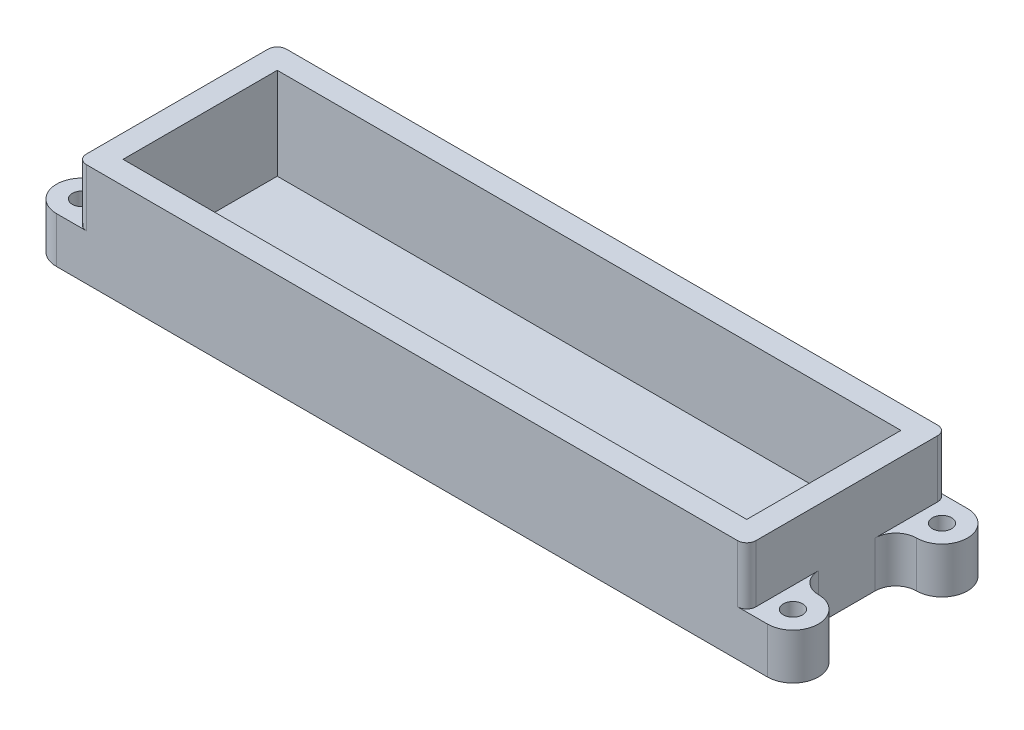
ISO-10303-21;
HEADER;
FILE_DESCRIPTION(('STEP AP214'),'2;1');
FILE_NAME('part.step','',(''),(''),'','','');
FILE_SCHEMA(('AUTOMOTIVE_DESIGN { 1 0 10303 214 1 1 1 1 }'));
ENDSEC;
DATA;
#1=APPLICATION_CONTEXT('core data for automotive mechanical design processes');
#2=APPLICATION_PROTOCOL_DEFINITION('international standard','automotive_design',2000,#1);
#3=PRODUCT_CONTEXT('',#1,'mechanical');
#4=PRODUCT('Part','Part','',(#3));
#5=PRODUCT_RELATED_PRODUCT_CATEGORY('part','',(#4));
#6=PRODUCT_DEFINITION_FORMATION('','',#4);
#7=PRODUCT_DEFINITION_CONTEXT('part definition',#1,'design');
#8=PRODUCT_DEFINITION('design','',#6,#7);
#9=PRODUCT_DEFINITION_SHAPE('','',#8);
#10=(LENGTH_UNIT() NAMED_UNIT(*) SI_UNIT(.MILLI.,.METRE.));
#11=(NAMED_UNIT(*) PLANE_ANGLE_UNIT() SI_UNIT($,.RADIAN.));
#12=(NAMED_UNIT(*) SI_UNIT($,.STERADIAN.) SOLID_ANGLE_UNIT());
#13=UNCERTAINTY_MEASURE_WITH_UNIT(LENGTH_MEASURE(1.E-05),#10,'distance_accuracy_value','');
#14=(GEOMETRIC_REPRESENTATION_CONTEXT(3) GLOBAL_UNCERTAINTY_ASSIGNED_CONTEXT((#13)) GLOBAL_UNIT_ASSIGNED_CONTEXT((#10,
#11,#12)) REPRESENTATION_CONTEXT('',''));
#15=CARTESIAN_POINT('',(0.,0.,0.));
#16=DIRECTION('',(0.,0.,1.));
#17=DIRECTION('',(1.,0.,0.));
#18=AXIS2_PLACEMENT_3D('',#15,#16,#17);
#19=CARTESIAN_POINT('',(0.,241.125180878468,0.));
#20=DIRECTION('',(-1.,0.,0.));
#21=DIRECTION('',(0.,0.,1.));
#22=AXIS2_PLACEMENT_3D('',#19,#20,#21);
#23=PLANE('',#22);
#24=DIRECTION('',(0.,0.,-1.));
#25=VECTOR('',#24,1.);
#26=CARTESIAN_POINT('',(0.,12.7,0.));
#27=LINE('',#26,#25);
#28=CARTESIAN_POINT('',(0.,12.7,-2.54));
#29=VERTEX_POINT('',#28);
#30=CARTESIAN_POINT('',(0.,12.7,-19.85));
#31=VERTEX_POINT('',#30);
#32=EDGE_CURVE('E381',#29,#31,#27,.T.);
#33=ORIENTED_EDGE('',*,*,#32,.F.);
#34=DIRECTION('',(0.,-1.,0.));
#35=VECTOR('',#34,1.);
#36=CARTESIAN_POINT('',(0.,28.575,-2.54));
#37=LINE('',#36,#35);
#38=CARTESIAN_POINT('',(0.,28.575,-2.54));
#39=VERTEX_POINT('',#38);
#40=EDGE_CURVE('E504',#29,#39,#37,.F.);
#41=ORIENTED_EDGE('',*,*,#40,.T.);
#42=DIRECTION('',(0.,0.,-1.));
#43=VECTOR('',#42,1.);
#44=CARTESIAN_POINT('',(0.,28.575,0.));
#45=LINE('',#44,#43);
#46=CARTESIAN_POINT('',(0.,28.575,-52.86));
#47=VERTEX_POINT('',#46);
#48=EDGE_CURVE('E414',#39,#47,#45,.T.);
#49=ORIENTED_EDGE('',*,*,#48,.T.);
#50=DIRECTION('',(0.,-1.,0.));
#51=VECTOR('',#50,1.);
#52=CARTESIAN_POINT('',(0.,241.125180878468,-52.86));
#53=LINE('',#52,#51);
#54=CARTESIAN_POINT('',(0.,12.7,-52.86));
#55=VERTEX_POINT('',#54);
#56=EDGE_CURVE('E500',#47,#55,#53,.T.);
#57=ORIENTED_EDGE('',*,*,#56,.T.);
#58=DIRECTION('',(0.,0.,-1.));
#59=VECTOR('',#58,1.);
#60=CARTESIAN_POINT('',(0.,12.7,0.));
#61=LINE('',#60,#59);
#62=CARTESIAN_POINT('',(0.,12.7,-35.55));
#63=VERTEX_POINT('',#62);
#64=EDGE_CURVE('E335',#63,#55,#61,.T.);
#65=ORIENTED_EDGE('',*,*,#64,.F.);
#66=DIRECTION('',(0.,-1.,0.));
#67=VECTOR('',#66,1.);
#68=CARTESIAN_POINT('',(0.,12.7,-35.55));
#69=LINE('',#68,#67);
#70=CARTESIAN_POINT('',(0.,0.,-35.55));
#71=VERTEX_POINT('',#70);
#72=EDGE_CURVE('E343',#63,#71,#69,.T.);
#73=ORIENTED_EDGE('',*,*,#72,.T.);
#74=DIRECTION('',(0.,0.,-1.));
#75=VECTOR('',#74,1.);
#76=CARTESIAN_POINT('',(0.,0.,0.));
#77=LINE('',#76,#75);
#78=CARTESIAN_POINT('',(0.,0.,-19.85));
#79=VERTEX_POINT('',#78);
#80=EDGE_CURVE('E439',#79,#71,#77,.T.);
#81=ORIENTED_EDGE('',*,*,#80,.F.);
#82=DIRECTION('',(0.,-1.,0.));
#83=VECTOR('',#82,1.);
#84=CARTESIAN_POINT('',(0.,12.7,-19.85));
#85=LINE('',#84,#83);
#86=EDGE_CURVE('E384',#31,#79,#85,.T.);
#87=ORIENTED_EDGE('',*,*,#86,.F.);
#88=EDGE_LOOP('',(#33,#41,#49,#57,#65,#73,#81,#87));
#89=FACE_BOUND('',#88,.T.);
#90=ADVANCED_FACE('F49',(#89),#23,.T.);
#91=CARTESIAN_POINT('',(0.,3.175,0.));
#92=DIRECTION('',(0.,1.,0.));
#93=DIRECTION('',(0.,0.,1.));
#94=AXIS2_PLACEMENT_3D('',#91,#92,#93);
#95=PLANE('',#94);
#96=CARTESIAN_POINT('',(142.7,3.175,-20.7));
#97=DIRECTION('',(0.,1.,0.));
#98=DIRECTION('',(0.,0.,1.));
#99=AXIS2_PLACEMENT_3D('',#96,#97,#98);
#100=CIRCLE('',#99,3.175);
#101=CARTESIAN_POINT('',(142.7,3.175,-17.525));
#102=VERTEX_POINT('',#101);
#103=EDGE_CURVE('E463',#102,#102,#100,.T.);
#104=ORIENTED_EDGE('',*,*,#103,.F.);
#105=EDGE_LOOP('',(#104));
#106=FACE_BOUND('',#105,.T.);
#107=CARTESIAN_POINT('',(42.7,3.175,-20.7));
#108=DIRECTION('',(0.,1.,0.));
#109=DIRECTION('',(0.,0.,1.));
#110=AXIS2_PLACEMENT_3D('',#107,#108,#109);
#111=CIRCLE('',#110,3.175);
#112=CARTESIAN_POINT('',(42.7,3.175,-17.525));
#113=VERTEX_POINT('',#112);
#114=EDGE_CURVE('E468',#113,#113,#111,.T.);
#115=ORIENTED_EDGE('',*,*,#114,.F.);
#116=EDGE_LOOP('',(#115));
#117=FACE_BOUND('',#116,.T.);
#118=DIRECTION('',(0.,0.,1.));
#119=VECTOR('',#118,1.);
#120=CARTESIAN_POINT('',(179.05,3.175,0.));
#121=LINE('',#120,#119);
#122=CARTESIAN_POINT('',(179.05,3.17500000000001,-49.05));
#123=VERTEX_POINT('',#122);
#124=CARTESIAN_POINT('',(179.05,3.175,-6.35));
#125=VERTEX_POINT('',#124);
#126=EDGE_CURVE('E476',#123,#125,#121,.T.);
#127=ORIENTED_EDGE('',*,*,#126,.F.);
#128=DIRECTION('',(1.,0.,0.));
#129=VECTOR('',#128,1.);
#130=CARTESIAN_POINT('',(0.,3.175,-49.05));
#131=LINE('',#130,#129);
#132=CARTESIAN_POINT('',(6.35,3.175,-49.05));
#133=VERTEX_POINT('',#132);
#134=EDGE_CURVE('E483',#133,#123,#131,.T.);
#135=ORIENTED_EDGE('',*,*,#134,.F.);
#136=DIRECTION('',(0.,0.,1.));
#137=VECTOR('',#136,1.);
#138=CARTESIAN_POINT('',(6.35,3.175,0.));
#139=LINE('',#138,#137);
#140=CARTESIAN_POINT('',(6.35,3.175,-6.35));
#141=VERTEX_POINT('',#140);
#142=EDGE_CURVE('E487',#133,#141,#139,.T.);
#143=ORIENTED_EDGE('',*,*,#142,.T.);
#144=DIRECTION('',(1.,0.,0.));
#145=VECTOR('',#144,1.);
#146=CARTESIAN_POINT('',(0.,3.175,-6.35));
#147=LINE('',#146,#145);
#148=EDGE_CURVE('E490',#141,#125,#147,.T.);
#149=ORIENTED_EDGE('',*,*,#148,.T.);
#150=EDGE_LOOP('',(#127,#135,#143,#149));
#151=FACE_BOUND('',#150,.T.);
#152=ADVANCED_FACE('F646',(#106,#117,#151),#95,.T.);
#153=CARTESIAN_POINT('',(42.7,9.525,-20.7));
#154=DIRECTION('',(0.,-1.,0.));
#155=DIRECTION('',(0.,0.,-1.));
#156=AXIS2_PLACEMENT_3D('',#153,#154,#155);
#157=CYLINDRICAL_SURFACE('',#156,3.175);
#158=CARTESIAN_POINT('',(42.7,9.525,-20.7));
#159=DIRECTION('',(0.,1.,0.));
#160=DIRECTION('',(0.,0.,1.));
#161=AXIS2_PLACEMENT_3D('',#158,#159,#160);
#162=CIRCLE('',#161,3.175);
#163=CARTESIAN_POINT('',(42.7,9.525,-17.525));
#164=VERTEX_POINT('',#163);
#165=EDGE_CURVE('E472',#164,#164,#162,.T.);
#166=ORIENTED_EDGE('',*,*,#165,.F.);
#167=EDGE_LOOP('',(#166));
#168=FACE_BOUND('',#167,.T.);
#169=ORIENTED_EDGE('',*,*,#114,.T.);
#170=EDGE_LOOP('',(#169));
#171=FACE_BOUND('',#170,.T.);
#172=ADVANCED_FACE('F651',(#168,#171),#157,.T.);
#173=CARTESIAN_POINT('',(42.7,9.525,-20.7));
#174=DIRECTION('',(0.,1.,0.));
#175=DIRECTION('',(0.,0.,1.));
#176=AXIS2_PLACEMENT_3D('',#173,#174,#175);
#177=PLANE('',#176);
#178=CARTESIAN_POINT('',(42.7,9.525,-20.7));
#179=DIRECTION('',(0.,1.,0.));
#180=DIRECTION('',(0.,0.,1.));
#181=AXIS2_PLACEMENT_3D('',#178,#179,#180);
#182=CIRCLE('',#181,0.799999999999988);
#183=CARTESIAN_POINT('',(42.7,9.525,-19.9));
#184=VERTEX_POINT('',#183);
#185=EDGE_CURVE('E227',#184,#184,#182,.T.);
#186=ORIENTED_EDGE('',*,*,#185,.F.);
#187=EDGE_LOOP('',(#186));
#188=FACE_BOUND('',#187,.T.);
#189=ORIENTED_EDGE('',*,*,#165,.T.);
#190=EDGE_LOOP('',(#189));
#191=FACE_BOUND('',#190,.T.);
#192=ADVANCED_FACE('F670',(#188,#191),#177,.T.);
#193=CARTESIAN_POINT('',(142.7,9.525,-20.7));
#194=DIRECTION('',(0.,-1.,0.));
#195=DIRECTION('',(0.,0.,-1.));
#196=AXIS2_PLACEMENT_3D('',#193,#194,#195);
#197=CYLINDRICAL_SURFACE('',#196,3.175);
#198=CARTESIAN_POINT('',(142.7,9.525,-20.7));
#199=DIRECTION('',(0.,1.,0.));
#200=DIRECTION('',(0.,0.,1.));
#201=AXIS2_PLACEMENT_3D('',#198,#199,#200);
#202=CIRCLE('',#201,3.175);
#203=CARTESIAN_POINT('',(142.7,9.525,-17.525));
#204=VERTEX_POINT('',#203);
#205=EDGE_CURVE('E464',#204,#204,#202,.T.);
#206=ORIENTED_EDGE('',*,*,#205,.F.);
#207=EDGE_LOOP('',(#206));
#208=FACE_BOUND('',#207,.T.);
#209=ORIENTED_EDGE('',*,*,#103,.T.);
#210=EDGE_LOOP('',(#209));
#211=FACE_BOUND('',#210,.T.);
#212=ADVANCED_FACE('F666',(#208,#211),#197,.T.);
#213=CARTESIAN_POINT('',(142.7,9.525,-20.7));
#214=DIRECTION('',(0.,1.,0.));
#215=DIRECTION('',(0.,0.,1.));
#216=AXIS2_PLACEMENT_3D('',#213,#214,#215);
#217=PLANE('',#216);
#218=CARTESIAN_POINT('',(142.7,9.525,-20.7));
#219=DIRECTION('',(0.,1.,0.));
#220=DIRECTION('',(0.,0.,1.));
#221=AXIS2_PLACEMENT_3D('',#218,#219,#220);
#222=CIRCLE('',#221,0.799999999999995);
#223=CARTESIAN_POINT('',(142.7,9.525,-19.9));
#224=VERTEX_POINT('',#223);
#225=EDGE_CURVE('E226',#224,#224,#222,.T.);
#226=ORIENTED_EDGE('',*,*,#225,.F.);
#227=EDGE_LOOP('',(#226));
#228=FACE_BOUND('',#227,.T.);
#229=ORIENTED_EDGE('',*,*,#205,.T.);
#230=EDGE_LOOP('',(#229));
#231=FACE_BOUND('',#230,.T.);
#232=ADVANCED_FACE('F658',(#228,#231),#217,.T.);
#233=CARTESIAN_POINT('',(0.,241.125180878468,-55.4));
#234=DIRECTION('',(0.,0.,-1.));
#235=DIRECTION('',(-1.,0.,0.));
#236=AXIS2_PLACEMENT_3D('',#233,#234,#235);
#237=PLANE('',#236);
#238=DIRECTION('',(-1.,0.,0.));
#239=VECTOR('',#238,1.);
#240=CARTESIAN_POINT('',(-2.68586705520671E-13,12.7,-55.4));
#241=LINE('',#240,#239);
#242=CARTESIAN_POINT('',(2.54,12.7,-55.4));
#243=VERTEX_POINT('',#242);
#244=CARTESIAN_POINT('',(-5.725,12.7,-55.4));
#245=VERTEX_POINT('',#244);
#246=EDGE_CURVE('E324',#243,#245,#241,.T.);
#247=ORIENTED_EDGE('',*,*,#246,.F.);
#248=DIRECTION('',(0.,-1.,0.));
#249=VECTOR('',#248,1.);
#250=CARTESIAN_POINT('',(2.54,241.125180878468,-55.4));
#251=LINE('',#250,#249);
#252=CARTESIAN_POINT('',(2.54,28.575,-55.4));
#253=VERTEX_POINT('',#252);
#254=EDGE_CURVE('E523',#243,#253,#251,.F.);
#255=ORIENTED_EDGE('',*,*,#254,.T.);
#256=DIRECTION('',(1.,0.,0.));
#257=VECTOR('',#256,1.);
#258=CARTESIAN_POINT('',(0.,28.575,-55.4));
#259=LINE('',#258,#257);
#260=CARTESIAN_POINT('',(182.86,28.575,-55.4));
#261=VERTEX_POINT('',#260);
#262=EDGE_CURVE('E418',#253,#261,#259,.T.);
#263=ORIENTED_EDGE('',*,*,#262,.T.);
#264=DIRECTION('',(0.,-1.,0.));
#265=VECTOR('',#264,1.);
#266=CARTESIAN_POINT('',(182.86,12.7,-55.4));
#267=LINE('',#266,#265);
#268=CARTESIAN_POINT('',(182.86,12.7,-55.4));
#269=VERTEX_POINT('',#268);
#270=EDGE_CURVE('E519',#261,#269,#267,.T.);
#271=ORIENTED_EDGE('',*,*,#270,.T.);
#272=DIRECTION('',(1.,0.,0.));
#273=VECTOR('',#272,1.);
#274=CARTESIAN_POINT('',(0.,12.7,-55.4000000000002));
#275=LINE('',#274,#273);
#276=CARTESIAN_POINT('',(191.125,12.7,-55.4));
#277=VERTEX_POINT('',#276);
#278=EDGE_CURVE('E245',#269,#277,#275,.T.);
#279=ORIENTED_EDGE('',*,*,#278,.T.);
#280=DIRECTION('',(0.,-1.,0.));
#281=VECTOR('',#280,1.);
#282=CARTESIAN_POINT('',(191.125,12.7,-55.4));
#283=LINE('',#282,#281);
#284=CARTESIAN_POINT('',(191.125,0.,-55.4));
#285=VERTEX_POINT('',#284);
#286=EDGE_CURVE('E278',#277,#285,#283,.T.);
#287=ORIENTED_EDGE('',*,*,#286,.T.);
#288=DIRECTION('',(1.,0.,0.));
#289=VECTOR('',#288,1.);
#290=CARTESIAN_POINT('',(0.,0.,-55.4));
#291=LINE('',#290,#289);
#292=CARTESIAN_POINT('',(-5.725,0.,-55.4));
#293=VERTEX_POINT('',#292);
#294=EDGE_CURVE('E436',#293,#285,#291,.T.);
#295=ORIENTED_EDGE('',*,*,#294,.F.);
#296=DIRECTION('',(0.,-1.,0.));
#297=VECTOR('',#296,1.);
#298=CARTESIAN_POINT('',(-5.725,12.7,-55.4));
#299=LINE('',#298,#297);
#300=EDGE_CURVE('E359',#245,#293,#299,.T.);
#301=ORIENTED_EDGE('',*,*,#300,.F.);
#302=EDGE_LOOP('',(#247,#255,#263,#271,#279,#287,#295,#301));
#303=FACE_BOUND('',#302,.T.);
#304=ADVANCED_FACE('F587',(#303),#237,.T.);
#305=CARTESIAN_POINT('',(185.4,241.125180878468,0.));
#306=DIRECTION('',(-1.,0.,0.));
#307=DIRECTION('',(0.,0.,1.));
#308=AXIS2_PLACEMENT_3D('',#305,#306,#307);
#309=PLANE('',#308);
#310=DIRECTION('',(0.,0.,-1.));
#311=VECTOR('',#310,1.);
#312=CARTESIAN_POINT('',(185.4,28.575,0.));
#313=LINE('',#312,#311);
#314=CARTESIAN_POINT('',(185.4,28.575,-2.54000000000002));
#315=VERTEX_POINT('',#314);
#316=CARTESIAN_POINT('',(185.4,28.575,-52.86));
#317=VERTEX_POINT('',#316);
#318=EDGE_CURVE('E422',#315,#317,#313,.T.);
#319=ORIENTED_EDGE('',*,*,#318,.F.);
#320=DIRECTION('',(0.,-1.,0.));
#321=VECTOR('',#320,1.);
#322=CARTESIAN_POINT('',(185.4,241.125180878468,-2.54000000000002));
#323=LINE('',#322,#321);
#324=CARTESIAN_POINT('',(185.4,12.7,-2.54000000000002));
#325=VERTEX_POINT('',#324);
#326=EDGE_CURVE('E529',#315,#325,#323,.T.);
#327=ORIENTED_EDGE('',*,*,#326,.T.);
#328=DIRECTION('',(0.,0.,-1.));
#329=VECTOR('',#328,1.);
#330=CARTESIAN_POINT('',(185.4,12.7,0.));
#331=LINE('',#330,#329);
#332=CARTESIAN_POINT('',(185.4,12.7,-19.8499999999999));
#333=VERTEX_POINT('',#332);
#334=EDGE_CURVE('E299',#325,#333,#331,.T.);
#335=ORIENTED_EDGE('',*,*,#334,.T.);
#336=DIRECTION('',(0.,-1.,0.));
#337=VECTOR('',#336,1.);
#338=CARTESIAN_POINT('',(185.4,12.7,-19.8499999999999));
#339=LINE('',#338,#337);
#340=CARTESIAN_POINT('',(185.4,0.,-19.8499999999999));
#341=VERTEX_POINT('',#340);
#342=EDGE_CURVE('E302',#333,#341,#339,.T.);
#343=ORIENTED_EDGE('',*,*,#342,.T.);
#344=DIRECTION('',(0.,0.,-1.));
#345=VECTOR('',#344,1.);
#346=CARTESIAN_POINT('',(185.4,0.,0.));
#347=LINE('',#346,#345);
#348=CARTESIAN_POINT('',(185.4,0.,-35.55));
#349=VERTEX_POINT('',#348);
#350=EDGE_CURVE('E433',#341,#349,#347,.T.);
#351=ORIENTED_EDGE('',*,*,#350,.T.);
#352=DIRECTION('',(0.,-1.,0.));
#353=VECTOR('',#352,1.);
#354=CARTESIAN_POINT('',(185.4,12.7,-35.5500000000001));
#355=LINE('',#354,#353);
#356=CARTESIAN_POINT('',(185.4,12.7,-35.5500000000001));
#357=VERTEX_POINT('',#356);
#358=EDGE_CURVE('E274',#357,#349,#355,.T.);
#359=ORIENTED_EDGE('',*,*,#358,.F.);
#360=DIRECTION('',(0.,0.,-1.));
#361=VECTOR('',#360,1.);
#362=CARTESIAN_POINT('',(185.4,12.7,0.));
#363=LINE('',#362,#361);
#364=CARTESIAN_POINT('',(185.4,12.7,-52.86));
#365=VERTEX_POINT('',#364);
#366=EDGE_CURVE('E250',#357,#365,#363,.T.);
#367=ORIENTED_EDGE('',*,*,#366,.T.);
#368=DIRECTION('',(0.,-1.,0.));
#369=VECTOR('',#368,1.);
#370=CARTESIAN_POINT('',(185.4,28.575,-52.86));
#371=LINE('',#370,#369);
#372=EDGE_CURVE('E526',#365,#317,#371,.F.);
#373=ORIENTED_EDGE('',*,*,#372,.T.);
#374=EDGE_LOOP('',(#319,#327,#335,#343,#351,#359,#367,#373));
#375=FACE_BOUND('',#374,.T.);
#376=ADVANCED_FACE('F580',(#375),#309,.F.);
#377=CARTESIAN_POINT('',(0.,241.125180878468,0.));
#378=DIRECTION('',(0.,0.,-1.));
#379=DIRECTION('',(-1.,0.,0.));
#380=AXIS2_PLACEMENT_3D('',#377,#378,#379);
#381=PLANE('',#380);
#382=DIRECTION('',(1.,0.,0.));
#383=VECTOR('',#382,1.);
#384=CARTESIAN_POINT('',(0.,28.575,0.));
#385=LINE('',#384,#383);
#386=CARTESIAN_POINT('',(2.54,28.575,0.));
#387=VERTEX_POINT('',#386);
#388=CARTESIAN_POINT('',(182.86,28.575,0.));
#389=VERTEX_POINT('',#388);
#390=EDGE_CURVE('E426',#387,#389,#385,.T.);
#391=ORIENTED_EDGE('',*,*,#390,.F.);
#392=DIRECTION('',(0.,-1.,0.));
#393=VECTOR('',#392,1.);
#394=CARTESIAN_POINT('',(2.54,12.7,0.));
#395=LINE('',#394,#393);
#396=CARTESIAN_POINT('',(2.54,12.7,0.));
#397=VERTEX_POINT('',#396);
#398=EDGE_CURVE('E496',#387,#397,#395,.T.);
#399=ORIENTED_EDGE('',*,*,#398,.T.);
#400=DIRECTION('',(-1.,0.,0.));
#401=VECTOR('',#400,1.);
#402=CARTESIAN_POINT('',(0.,12.7,0.));
#403=LINE('',#402,#401);
#404=CARTESIAN_POINT('',(-5.725,12.7,0.));
#405=VERTEX_POINT('',#404);
#406=EDGE_CURVE('E377',#397,#405,#403,.T.);
#407=ORIENTED_EDGE('',*,*,#406,.T.);
#408=DIRECTION('',(0.,-1.,0.));
#409=VECTOR('',#408,1.);
#410=CARTESIAN_POINT('',(-5.725,12.7,0.));
#411=LINE('',#410,#409);
#412=CARTESIAN_POINT('',(-5.725,0.,0.));
#413=VERTEX_POINT('',#412);
#414=EDGE_CURVE('E397',#405,#413,#411,.T.);
#415=ORIENTED_EDGE('',*,*,#414,.T.);
#416=DIRECTION('',(1.,0.,0.));
#417=VECTOR('',#416,1.);
#418=CARTESIAN_POINT('',(0.,0.,0.));
#419=LINE('',#418,#417);
#420=CARTESIAN_POINT('',(191.125,0.,0.));
#421=VERTEX_POINT('',#420);
#422=EDGE_CURVE('E430',#413,#421,#419,.T.);
#423=ORIENTED_EDGE('',*,*,#422,.T.);
#424=DIRECTION('',(0.,-1.,0.));
#425=VECTOR('',#424,1.);
#426=CARTESIAN_POINT('',(191.125,12.7,0.));
#427=LINE('',#426,#425);
#428=CARTESIAN_POINT('',(191.125,12.7,0.));
#429=VERTEX_POINT('',#428);
#430=EDGE_CURVE('E319',#429,#421,#427,.T.);
#431=ORIENTED_EDGE('',*,*,#430,.F.);
#432=DIRECTION('',(1.,0.,0.));
#433=VECTOR('',#432,1.);
#434=CARTESIAN_POINT('',(0.,12.7,0.));
#435=LINE('',#434,#433);
#436=CARTESIAN_POINT('',(182.86,12.7,0.));
#437=VERTEX_POINT('',#436);
#438=EDGE_CURVE('E287',#437,#429,#435,.T.);
#439=ORIENTED_EDGE('',*,*,#438,.F.);
#440=DIRECTION('',(0.,-1.,0.));
#441=VECTOR('',#440,1.);
#442=CARTESIAN_POINT('',(182.86,241.125180878468,0.));
#443=LINE('',#442,#441);
#444=EDGE_CURVE('E493',#437,#389,#443,.F.);
#445=ORIENTED_EDGE('',*,*,#444,.T.);
#446=EDGE_LOOP('',(#391,#399,#407,#415,#423,#431,#439,#445));
#447=FACE_BOUND('',#446,.T.);
#448=ADVANCED_FACE('F547',(#447),#381,.F.);
#449=CARTESIAN_POINT('',(6.35,241.125180878468,0.));
#450=DIRECTION('',(1.,0.,0.));
#451=DIRECTION('',(0.,0.,-1.));
#452=AXIS2_PLACEMENT_3D('',#449,#450,#451);
#453=PLANE('',#452);
#454=DIRECTION('',(0.,-1.,0.));
#455=VECTOR('',#454,1.);
#456=CARTESIAN_POINT('',(6.35,241.125180878468,-6.35));
#457=LINE('',#456,#455);
#458=CARTESIAN_POINT('',(6.35,28.575,-6.35));
#459=VERTEX_POINT('',#458);
#460=EDGE_CURVE('E447',#459,#141,#457,.T.);
#461=ORIENTED_EDGE('',*,*,#460,.T.);
#462=ORIENTED_EDGE('',*,*,#142,.F.);
#463=DIRECTION('',(0.,-1.,0.));
#464=VECTOR('',#463,1.);
#465=CARTESIAN_POINT('',(6.35,241.125180878468,-49.05));
#466=LINE('',#465,#464);
#467=CARTESIAN_POINT('',(6.35,28.575,-49.05));
#468=VERTEX_POINT('',#467);
#469=EDGE_CURVE('E443',#468,#133,#466,.T.);
#470=ORIENTED_EDGE('',*,*,#469,.F.);
#471=DIRECTION('',(0.,0.,1.));
#472=VECTOR('',#471,1.);
#473=CARTESIAN_POINT('',(6.35,28.575,0.));
#474=LINE('',#473,#472);
#475=EDGE_CURVE('E459',#468,#459,#474,.T.);
#476=ORIENTED_EDGE('',*,*,#475,.T.);
#477=EDGE_LOOP('',(#461,#462,#470,#476));
#478=FACE_BOUND('',#477,.T.);
#479=ADVANCED_FACE('F663',(#478),#453,.T.);
#480=CARTESIAN_POINT('',(0.,241.125180878468,-6.35));
#481=DIRECTION('',(0.,0.,-1.));
#482=DIRECTION('',(-1.,0.,0.));
#483=AXIS2_PLACEMENT_3D('',#480,#481,#482);
#484=PLANE('',#483);
#485=DIRECTION('',(0.,-1.,0.));
#486=VECTOR('',#485,1.);
#487=CARTESIAN_POINT('',(179.05,241.125180878468,-6.35));
#488=LINE('',#487,#486);
#489=CARTESIAN_POINT('',(179.05,28.575,-6.35));
#490=VERTEX_POINT('',#489);
#491=EDGE_CURVE('E451',#490,#125,#488,.T.);
#492=ORIENTED_EDGE('',*,*,#491,.T.);
#493=ORIENTED_EDGE('',*,*,#148,.F.);
#494=ORIENTED_EDGE('',*,*,#460,.F.);
#495=DIRECTION('',(1.,0.,0.));
#496=VECTOR('',#495,1.);
#497=CARTESIAN_POINT('',(0.,28.575,-6.35));
#498=LINE('',#497,#496);
#499=EDGE_CURVE('E404',#459,#490,#498,.T.);
#500=ORIENTED_EDGE('',*,*,#499,.T.);
#501=EDGE_LOOP('',(#492,#493,#494,#500));
#502=FACE_BOUND('',#501,.T.);
#503=ADVANCED_FACE('F697',(#502),#484,.T.);
#504=CARTESIAN_POINT('',(179.05,241.125180878468,0.));
#505=DIRECTION('',(1.,0.,0.));
#506=DIRECTION('',(0.,0.,-1.));
#507=AXIS2_PLACEMENT_3D('',#504,#505,#506);
#508=PLANE('',#507);
#509=ORIENTED_EDGE('',*,*,#126,.T.);
#510=ORIENTED_EDGE('',*,*,#491,.F.);
#511=DIRECTION('',(0.,0.,1.));
#512=VECTOR('',#511,1.);
#513=CARTESIAN_POINT('',(179.05,28.575,0.));
#514=LINE('',#513,#512);
#515=CARTESIAN_POINT('',(179.05,28.575,-49.05));
#516=VERTEX_POINT('',#515);
#517=EDGE_CURVE('E408',#516,#490,#514,.T.);
#518=ORIENTED_EDGE('',*,*,#517,.F.);
#519=DIRECTION('',(0.,-1.,0.));
#520=VECTOR('',#519,1.);
#521=CARTESIAN_POINT('',(179.05,241.125180878468,-49.05));
#522=LINE('',#521,#520);
#523=EDGE_CURVE('E455',#516,#123,#522,.T.);
#524=ORIENTED_EDGE('',*,*,#523,.T.);
#525=EDGE_LOOP('',(#509,#510,#518,#524));
#526=FACE_BOUND('',#525,.T.);
#527=ADVANCED_FACE('F693',(#526),#508,.F.);
#528=CARTESIAN_POINT('',(0.,241.125180878468,-49.05));
#529=DIRECTION('',(0.,0.,-1.));
#530=DIRECTION('',(-1.,0.,0.));
#531=AXIS2_PLACEMENT_3D('',#528,#529,#530);
#532=PLANE('',#531);
#533=ORIENTED_EDGE('',*,*,#134,.T.);
#534=ORIENTED_EDGE('',*,*,#523,.F.);
#535=DIRECTION('',(1.,0.,0.));
#536=VECTOR('',#535,1.);
#537=CARTESIAN_POINT('',(0.,28.575,-49.05));
#538=LINE('',#537,#536);
#539=EDGE_CURVE('E411',#468,#516,#538,.T.);
#540=ORIENTED_EDGE('',*,*,#539,.F.);
#541=ORIENTED_EDGE('',*,*,#469,.T.);
#542=EDGE_LOOP('',(#533,#534,#540,#541));
#543=FACE_BOUND('',#542,.T.);
#544=ADVANCED_FACE('F640',(#543),#532,.F.);
#545=CARTESIAN_POINT('',(42.7,28.575,-20.7));
#546=DIRECTION('',(0.,1.,0.));
#547=DIRECTION('',(0.,0.,1.));
#548=AXIS2_PLACEMENT_3D('',#545,#546,#547);
#549=PLANE('',#548);
#550=ORIENTED_EDGE('',*,*,#475,.F.);
#551=ORIENTED_EDGE('',*,*,#539,.T.);
#552=ORIENTED_EDGE('',*,*,#517,.T.);
#553=ORIENTED_EDGE('',*,*,#499,.F.);
#554=EDGE_LOOP('',(#550,#551,#552,#553));
#555=FACE_BOUND('',#554,.T.);
#556=ORIENTED_EDGE('',*,*,#48,.F.);
#557=CARTESIAN_POINT('',(2.54,28.575,-2.54));
#558=DIRECTION('',(0.,1.,0.));
#559=DIRECTION('',(0.,0.,1.));
#560=AXIS2_PLACEMENT_3D('',#557,#558,#559);
#561=CIRCLE('',#560,2.54);
#562=EDGE_CURVE('E516',#39,#387,#561,.T.);
#563=ORIENTED_EDGE('',*,*,#562,.T.);
#564=ORIENTED_EDGE('',*,*,#390,.T.);
#565=CARTESIAN_POINT('',(182.86,28.575,-2.54000000000002));
#566=DIRECTION('',(0.,1.,0.));
#567=DIRECTION('',(0.,0.,1.));
#568=AXIS2_PLACEMENT_3D('',#565,#566,#567);
#569=CIRCLE('',#568,2.54);
#570=EDGE_CURVE('E510',#389,#315,#569,.T.);
#571=ORIENTED_EDGE('',*,*,#570,.T.);
#572=ORIENTED_EDGE('',*,*,#318,.T.);
#573=CARTESIAN_POINT('',(182.86,28.575,-52.86));
#574=DIRECTION('',(0.,1.,0.));
#575=DIRECTION('',(0.,0.,1.));
#576=AXIS2_PLACEMENT_3D('',#573,#574,#575);
#577=CIRCLE('',#576,2.54);
#578=EDGE_CURVE('E507',#317,#261,#577,.T.);
#579=ORIENTED_EDGE('',*,*,#578,.T.);
#580=ORIENTED_EDGE('',*,*,#262,.F.);
#581=CARTESIAN_POINT('',(2.54,28.575,-52.86));
#582=DIRECTION('',(0.,1.,0.));
#583=DIRECTION('',(0.,0.,1.));
#584=AXIS2_PLACEMENT_3D('',#581,#582,#583);
#585=CIRCLE('',#584,2.54);
#586=EDGE_CURVE('E513',#253,#47,#585,.T.);
#587=ORIENTED_EDGE('',*,*,#586,.T.);
#588=EDGE_LOOP('',(#556,#563,#564,#571,#572,#579,#580,#587));
#589=FACE_BOUND('',#588,.T.);
#590=ADVANCED_FACE('F551',(#555,#589),#549,.T.);
#591=CARTESIAN_POINT('',(0.,0.,0.));
#592=DIRECTION('',(0.,1.,0.));
#593=DIRECTION('',(0.,0.,1.));
#594=AXIS2_PLACEMENT_3D('',#591,#592,#593);
#595=PLANE('',#594);
#596=ORIENTED_EDGE('',*,*,#422,.F.);
#597=CARTESIAN_POINT('',(-5.725,0.,-7.06250000000002));
#598=DIRECTION('',(0.,1.,0.));
#599=DIRECTION('',(0.,0.,1.));
#600=AXIS2_PLACEMENT_3D('',#597,#598,#599);
#601=CIRCLE('',#600,7.06250000000002);
#602=CARTESIAN_POINT('',(-5.725,0.,-14.125));
#603=VERTEX_POINT('',#602);
#604=EDGE_CURVE('E369',#413,#603,#601,.F.);
#605=ORIENTED_EDGE('',*,*,#604,.T.);
#606=CARTESIAN_POINT('',(-5.725,0.,-19.85));
#607=DIRECTION('',(0.,1.,0.));
#608=DIRECTION('',(0.,0.,1.));
#609=AXIS2_PLACEMENT_3D('',#606,#607,#608);
#610=CIRCLE('',#609,5.725);
#611=EDGE_CURVE('E388',#603,#79,#610,.T.);
#612=ORIENTED_EDGE('',*,*,#611,.T.);
#613=ORIENTED_EDGE('',*,*,#80,.T.);
#614=CARTESIAN_POINT('',(-5.725,0.,-35.55));
#615=DIRECTION('',(0.,1.,0.));
#616=DIRECTION('',(0.,0.,1.));
#617=AXIS2_PLACEMENT_3D('',#614,#615,#616);
#618=CIRCLE('',#617,5.725);
#619=CARTESIAN_POINT('',(-5.725,0.,-41.275));
#620=VERTEX_POINT('',#619);
#621=EDGE_CURVE('E346',#620,#71,#618,.F.);
#622=ORIENTED_EDGE('',*,*,#621,.F.);
#623=CARTESIAN_POINT('',(-5.72499999999999,0.,-48.3375));
#624=DIRECTION('',(0.,1.,0.));
#625=DIRECTION('',(0.,0.,1.));
#626=AXIS2_PLACEMENT_3D('',#623,#624,#625);
#627=CIRCLE('',#626,7.06250000000001);
#628=EDGE_CURVE('E323',#293,#620,#627,.T.);
#629=ORIENTED_EDGE('',*,*,#628,.F.);
#630=ORIENTED_EDGE('',*,*,#294,.T.);
#631=CARTESIAN_POINT('',(191.125,0.,-48.3375));
#632=DIRECTION('',(0.,1.,0.));
#633=DIRECTION('',(0.,0.,1.));
#634=AXIS2_PLACEMENT_3D('',#631,#632,#633);
#635=CIRCLE('',#634,7.06250000000001);
#636=CARTESIAN_POINT('',(191.125,0.,-41.275));
#637=VERTEX_POINT('',#636);
#638=EDGE_CURVE('E240',#285,#637,#635,.F.);
#639=ORIENTED_EDGE('',*,*,#638,.T.);
#640=CARTESIAN_POINT('',(191.125,0.,-35.55));
#641=DIRECTION('',(0.,1.,0.));
#642=DIRECTION('',(0.,0.,1.));
#643=AXIS2_PLACEMENT_3D('',#640,#641,#642);
#644=CIRCLE('',#643,5.725);
#645=EDGE_CURVE('E265',#637,#349,#644,.T.);
#646=ORIENTED_EDGE('',*,*,#645,.T.);
#647=ORIENTED_EDGE('',*,*,#350,.F.);
#648=CARTESIAN_POINT('',(191.125,0.,-19.8500000000001));
#649=DIRECTION('',(0.,1.,0.));
#650=DIRECTION('',(0.,0.,1.));
#651=AXIS2_PLACEMENT_3D('',#648,#649,#650);
#652=CIRCLE('',#651,5.725);
#653=CARTESIAN_POINT('',(191.125,0.,-14.1250000000001));
#654=VERTEX_POINT('',#653);
#655=EDGE_CURVE('E288',#654,#341,#652,.F.);
#656=ORIENTED_EDGE('',*,*,#655,.F.);
#657=CARTESIAN_POINT('',(191.125,0.,-7.06250000000005));
#658=DIRECTION('',(0.,1.,0.));
#659=DIRECTION('',(0.,0.,1.));
#660=AXIS2_PLACEMENT_3D('',#657,#658,#659);
#661=CIRCLE('',#660,7.06250000000002);
#662=EDGE_CURVE('E306',#421,#654,#661,.T.);
#663=ORIENTED_EDGE('',*,*,#662,.F.);
#664=EDGE_LOOP('',(#596,#605,#612,#613,#622,#629,#630,#639,#646,#647,#656,#663));
#665=FACE_BOUND('',#664,.T.);
#666=CARTESIAN_POINT('',(-5.725,0.,-7.06250000000002));
#667=DIRECTION('',(0.,1.,0.));
#668=DIRECTION('',(0.,0.,1.));
#669=AXIS2_PLACEMENT_3D('',#666,#667,#668);
#670=CIRCLE('',#669,2.667);
#671=CARTESIAN_POINT('',(-5.725,0.,-4.39550000000002));
#672=VERTEX_POINT('',#671);
#673=EDGE_CURVE('E363',#672,#672,#670,.T.);
#674=ORIENTED_EDGE('',*,*,#673,.T.);
#675=EDGE_LOOP('',(#674));
#676=FACE_BOUND('',#675,.T.);
#677=CARTESIAN_POINT('',(-5.72499999999999,0.,-48.3375));
#678=DIRECTION('',(0.,1.,0.));
#679=DIRECTION('',(0.,0.,1.));
#680=AXIS2_PLACEMENT_3D('',#677,#678,#679);
#681=CIRCLE('',#680,2.667);
#682=CARTESIAN_POINT('',(-5.72499999999999,0.,-45.6705));
#683=VERTEX_POINT('',#682);
#684=EDGE_CURVE('E329',#683,#683,#681,.F.);
#685=ORIENTED_EDGE('',*,*,#684,.F.);
#686=EDGE_LOOP('',(#685));
#687=FACE_BOUND('',#686,.T.);
#688=CARTESIAN_POINT('',(191.125,0.,-7.06250000000005));
#689=DIRECTION('',(0.,1.,0.));
#690=DIRECTION('',(0.,0.,1.));
#691=AXIS2_PLACEMENT_3D('',#688,#689,#690);
#692=CIRCLE('',#691,2.66699999999997);
#693=CARTESIAN_POINT('',(191.125,0.,-4.39550000000008));
#694=VERTEX_POINT('',#693);
#695=EDGE_CURVE('E282',#694,#694,#692,.F.);
#696=ORIENTED_EDGE('',*,*,#695,.F.);
#697=EDGE_LOOP('',(#696));
#698=FACE_BOUND('',#697,.T.);
#699=CARTESIAN_POINT('',(191.125,0.,-48.3375));
#700=DIRECTION('',(0.,1.,0.));
#701=DIRECTION('',(0.,0.,1.));
#702=AXIS2_PLACEMENT_3D('',#699,#700,#701);
#703=CIRCLE('',#702,2.66699999999997);
#704=CARTESIAN_POINT('',(191.125,0.,-45.6705000000001));
#705=VERTEX_POINT('',#704);
#706=EDGE_CURVE('E246',#705,#705,#703,.T.);
#707=ORIENTED_EDGE('',*,*,#706,.T.);
#708=EDGE_LOOP('',(#707));
#709=FACE_BOUND('',#708,.T.);
#710=ADVANCED_FACE('F568',(#665,#676,#687,#698,#709),#595,.F.);
#711=CARTESIAN_POINT('',(-5.725,12.7,-19.85));
#712=DIRECTION('',(0.,-1.,0.));
#713=DIRECTION('',(0.,0.,-1.));
#714=AXIS2_PLACEMENT_3D('',#711,#712,#713);
#715=CYLINDRICAL_SURFACE('',#714,5.725);
#716=ORIENTED_EDGE('',*,*,#611,.F.);
#717=DIRECTION('',(0.,-1.,0.));
#718=VECTOR('',#717,1.);
#719=CARTESIAN_POINT('',(-5.725,12.7,-14.125));
#720=LINE('',#719,#718);
#721=CARTESIAN_POINT('',(-5.725,12.7,-14.125));
#722=VERTEX_POINT('',#721);
#723=EDGE_CURVE('E401',#722,#603,#720,.T.);
#724=ORIENTED_EDGE('',*,*,#723,.F.);
#725=CARTESIAN_POINT('',(-5.725,12.7,-19.85));
#726=DIRECTION('',(0.,1.,0.));
#727=DIRECTION('',(0.,0.,1.));
#728=AXIS2_PLACEMENT_3D('',#725,#726,#727);
#729=CIRCLE('',#728,5.725);
#730=EDGE_CURVE('E368',#722,#31,#729,.T.);
#731=ORIENTED_EDGE('',*,*,#730,.T.);
#732=ORIENTED_EDGE('',*,*,#86,.T.);
#733=EDGE_LOOP('',(#716,#724,#731,#732));
#734=FACE_BOUND('',#733,.T.);
#735=ADVANCED_FACE('F632',(#734),#715,.F.);
#736=CARTESIAN_POINT('',(-5.725,12.7,-7.06250000000002));
#737=DIRECTION('',(0.,-1.,0.));
#738=DIRECTION('',(0.,0.,-1.));
#739=AXIS2_PLACEMENT_3D('',#736,#737,#738);
#740=CYLINDRICAL_SURFACE('',#739,7.06250000000002);
#741=ORIENTED_EDGE('',*,*,#604,.F.);
#742=ORIENTED_EDGE('',*,*,#414,.F.);
#743=CARTESIAN_POINT('',(-5.725,12.7,-7.06250000000002));
#744=DIRECTION('',(0.,1.,0.));
#745=DIRECTION('',(0.,0.,1.));
#746=AXIS2_PLACEMENT_3D('',#743,#744,#745);
#747=CIRCLE('',#746,7.06250000000002);
#748=EDGE_CURVE('E373',#405,#722,#747,.F.);
#749=ORIENTED_EDGE('',*,*,#748,.T.);
#750=ORIENTED_EDGE('',*,*,#723,.T.);
#751=EDGE_LOOP('',(#741,#742,#749,#750));
#752=FACE_BOUND('',#751,.T.);
#753=ADVANCED_FACE('F565',(#752),#740,.T.);
#754=CARTESIAN_POINT('',(-5.725,12.7,-7.06250000000002));
#755=DIRECTION('',(0.,-1.,0.));
#756=DIRECTION('',(0.,0.,-1.));
#757=AXIS2_PLACEMENT_3D('',#754,#755,#756);
#758=CYLINDRICAL_SURFACE('',#757,2.667);
#759=CARTESIAN_POINT('',(-5.725,12.7,-7.06250000000002));
#760=DIRECTION('',(0.,1.,0.));
#761=DIRECTION('',(0.,0.,1.));
#762=AXIS2_PLACEMENT_3D('',#759,#760,#761);
#763=CIRCLE('',#762,2.667);
#764=CARTESIAN_POINT('',(-5.725,12.7,-4.39550000000002));
#765=VERTEX_POINT('',#764);
#766=EDGE_CURVE('E364',#765,#765,#763,.T.);
#767=ORIENTED_EDGE('',*,*,#766,.T.);
#768=EDGE_LOOP('',(#767));
#769=FACE_BOUND('',#768,.T.);
#770=ORIENTED_EDGE('',*,*,#673,.F.);
#771=EDGE_LOOP('',(#770));
#772=FACE_BOUND('',#771,.T.);
#773=ADVANCED_FACE('F706',(#769,#772),#758,.F.);
#774=CARTESIAN_POINT('',(0.,12.7,0.));
#775=DIRECTION('',(0.,1.,0.));
#776=DIRECTION('',(0.,0.,1.));
#777=AXIS2_PLACEMENT_3D('',#774,#775,#776);
#778=PLANE('',#777);
#779=ORIENTED_EDGE('',*,*,#766,.F.);
#780=EDGE_LOOP('',(#779));
#781=FACE_BOUND('',#780,.T.);
#782=ORIENTED_EDGE('',*,*,#730,.F.);
#783=ORIENTED_EDGE('',*,*,#748,.F.);
#784=ORIENTED_EDGE('',*,*,#406,.F.);
#785=CARTESIAN_POINT('',(2.54,12.7,-2.54));
#786=DIRECTION('',(0.,1.,0.));
#787=DIRECTION('',(0.,0.,1.));
#788=AXIS2_PLACEMENT_3D('',#785,#786,#787);
#789=CIRCLE('',#788,2.54);
#790=EDGE_CURVE('E532',#397,#29,#789,.F.);
#791=ORIENTED_EDGE('',*,*,#790,.T.);
#792=ORIENTED_EDGE('',*,*,#32,.T.);
#793=EDGE_LOOP('',(#782,#783,#784,#791,#792));
#794=FACE_BOUND('',#793,.T.);
#795=ADVANCED_FACE('F562',(#781,#794),#778,.T.);
#796=CARTESIAN_POINT('',(-5.72499999999999,12.7,-48.3375));
#797=DIRECTION('',(0.,-1.,0.));
#798=DIRECTION('',(0.,0.,-1.));
#799=AXIS2_PLACEMENT_3D('',#796,#797,#798);
#800=CYLINDRICAL_SURFACE('',#799,7.06250000000001);
#801=ORIENTED_EDGE('',*,*,#628,.T.);
#802=DIRECTION('',(0.,-1.,0.));
#803=VECTOR('',#802,1.);
#804=CARTESIAN_POINT('',(-5.725,12.7,-41.275));
#805=LINE('',#804,#803);
#806=CARTESIAN_POINT('',(-5.725,12.7,-41.275));
#807=VERTEX_POINT('',#806);
#808=EDGE_CURVE('E355',#807,#620,#805,.T.);
#809=ORIENTED_EDGE('',*,*,#808,.F.);
#810=CARTESIAN_POINT('',(-5.72499999999999,12.7,-48.3375));
#811=DIRECTION('',(0.,1.,0.));
#812=DIRECTION('',(0.,0.,1.));
#813=AXIS2_PLACEMENT_3D('',#810,#811,#812);
#814=CIRCLE('',#813,7.06250000000001);
#815=EDGE_CURVE('E328',#245,#807,#814,.T.);
#816=ORIENTED_EDGE('',*,*,#815,.F.);
#817=ORIENTED_EDGE('',*,*,#300,.T.);
#818=EDGE_LOOP('',(#801,#809,#816,#817));
#819=FACE_BOUND('',#818,.T.);
#820=ADVANCED_FACE('F609',(#819),#800,.T.);
#821=CARTESIAN_POINT('',(-5.725,12.7,-35.55));
#822=DIRECTION('',(0.,-1.,0.));
#823=DIRECTION('',(0.,0.,-1.));
#824=AXIS2_PLACEMENT_3D('',#821,#822,#823);
#825=CYLINDRICAL_SURFACE('',#824,5.725);
#826=ORIENTED_EDGE('',*,*,#621,.T.);
#827=ORIENTED_EDGE('',*,*,#72,.F.);
#828=CARTESIAN_POINT('',(-5.725,12.7,-35.55));
#829=DIRECTION('',(0.,1.,0.));
#830=DIRECTION('',(0.,0.,1.));
#831=AXIS2_PLACEMENT_3D('',#828,#829,#830);
#832=CIRCLE('',#831,5.725);
#833=EDGE_CURVE('E332',#807,#63,#832,.F.);
#834=ORIENTED_EDGE('',*,*,#833,.F.);
#835=ORIENTED_EDGE('',*,*,#808,.T.);
#836=EDGE_LOOP('',(#826,#827,#834,#835));
#837=FACE_BOUND('',#836,.T.);
#838=ADVANCED_FACE('F602',(#837),#825,.F.);
#839=CARTESIAN_POINT('',(-5.72499999999999,12.7,-48.3375));
#840=DIRECTION('',(0.,-1.,0.));
#841=DIRECTION('',(0.,0.,-1.));
#842=AXIS2_PLACEMENT_3D('',#839,#840,#841);
#843=CYLINDRICAL_SURFACE('',#842,2.667);
#844=CARTESIAN_POINT('',(-5.72499999999999,12.7,-48.3375));
#845=DIRECTION('',(0.,1.,0.));
#846=DIRECTION('',(0.,0.,1.));
#847=AXIS2_PLACEMENT_3D('',#844,#845,#846);
#848=CIRCLE('',#847,2.667);
#849=CARTESIAN_POINT('',(-5.72499999999999,12.7,-45.6705));
#850=VERTEX_POINT('',#849);
#851=EDGE_CURVE('E339',#850,#850,#848,.F.);
#852=ORIENTED_EDGE('',*,*,#851,.F.);
#853=EDGE_LOOP('',(#852));
#854=FACE_BOUND('',#853,.T.);
#855=ORIENTED_EDGE('',*,*,#684,.T.);
#856=EDGE_LOOP('',(#855));
#857=FACE_BOUND('',#856,.T.);
#858=ADVANCED_FACE('F719',(#854,#857),#843,.F.);
#859=CARTESIAN_POINT('',(0.,12.7,0.));
#860=DIRECTION('',(0.,1.,0.));
#861=DIRECTION('',(0.,0.,1.));
#862=AXIS2_PLACEMENT_3D('',#859,#860,#861);
#863=PLANE('',#862);
#864=ORIENTED_EDGE('',*,*,#246,.T.);
#865=ORIENTED_EDGE('',*,*,#815,.T.);
#866=ORIENTED_EDGE('',*,*,#833,.T.);
#867=ORIENTED_EDGE('',*,*,#64,.T.);
#868=CARTESIAN_POINT('',(2.54,12.7,-52.86));
#869=DIRECTION('',(0.,1.,0.));
#870=DIRECTION('',(0.,0.,1.));
#871=AXIS2_PLACEMENT_3D('',#868,#869,#870);
#872=CIRCLE('',#871,2.54);
#873=EDGE_CURVE('E535',#55,#243,#872,.F.);
#874=ORIENTED_EDGE('',*,*,#873,.T.);
#875=EDGE_LOOP('',(#864,#865,#866,#867,#874));
#876=FACE_BOUND('',#875,.T.);
#877=ORIENTED_EDGE('',*,*,#851,.T.);
#878=EDGE_LOOP('',(#877));
#879=FACE_BOUND('',#878,.T.);
#880=ADVANCED_FACE('F596',(#876,#879),#863,.T.);
#881=CARTESIAN_POINT('',(191.125,12.7,-7.06250000000005));
#882=DIRECTION('',(0.,-1.,0.));
#883=DIRECTION('',(0.,0.,-1.));
#884=AXIS2_PLACEMENT_3D('',#881,#882,#883);
#885=CYLINDRICAL_SURFACE('',#884,7.06250000000002);
#886=ORIENTED_EDGE('',*,*,#662,.T.);
#887=DIRECTION('',(0.,-1.,0.));
#888=VECTOR('',#887,1.);
#889=CARTESIAN_POINT('',(191.125,12.7,-14.1250000000001));
#890=LINE('',#889,#888);
#891=CARTESIAN_POINT('',(191.125,12.7,-14.1250000000001));
#892=VERTEX_POINT('',#891);
#893=EDGE_CURVE('E315',#892,#654,#890,.T.);
#894=ORIENTED_EDGE('',*,*,#893,.F.);
#895=CARTESIAN_POINT('',(191.125,12.7,-7.06250000000005));
#896=DIRECTION('',(0.,1.,0.));
#897=DIRECTION('',(0.,0.,1.));
#898=AXIS2_PLACEMENT_3D('',#895,#896,#897);
#899=CIRCLE('',#898,7.06250000000002);
#900=EDGE_CURVE('E292',#429,#892,#899,.T.);
#901=ORIENTED_EDGE('',*,*,#900,.F.);
#902=ORIENTED_EDGE('',*,*,#430,.T.);
#903=EDGE_LOOP('',(#886,#894,#901,#902));
#904=FACE_BOUND('',#903,.T.);
#905=ADVANCED_FACE('F573',(#904),#885,.T.);
#906=CARTESIAN_POINT('',(191.125,12.7,-19.8500000000001));
#907=DIRECTION('',(0.,-1.,0.));
#908=DIRECTION('',(0.,0.,-1.));
#909=AXIS2_PLACEMENT_3D('',#906,#907,#908);
#910=CYLINDRICAL_SURFACE('',#909,5.725);
#911=ORIENTED_EDGE('',*,*,#655,.T.);
#912=ORIENTED_EDGE('',*,*,#342,.F.);
#913=CARTESIAN_POINT('',(191.125,12.7,-19.8500000000001));
#914=DIRECTION('',(0.,1.,0.));
#915=DIRECTION('',(0.,0.,1.));
#916=AXIS2_PLACEMENT_3D('',#913,#914,#915);
#917=CIRCLE('',#916,5.725);
#918=EDGE_CURVE('E295',#892,#333,#917,.F.);
#919=ORIENTED_EDGE('',*,*,#918,.F.);
#920=ORIENTED_EDGE('',*,*,#893,.T.);
#921=EDGE_LOOP('',(#911,#912,#919,#920));
#922=FACE_BOUND('',#921,.T.);
#923=ADVANCED_FACE('F578',(#922),#910,.F.);
#924=CARTESIAN_POINT('',(191.125,12.7,-7.06250000000005));
#925=DIRECTION('',(0.,-1.,0.));
#926=DIRECTION('',(0.,0.,-1.));
#927=AXIS2_PLACEMENT_3D('',#924,#925,#926);
#928=CYLINDRICAL_SURFACE('',#927,2.66699999999997);
#929=CARTESIAN_POINT('',(191.125,12.7,-7.06250000000005));
#930=DIRECTION('',(0.,1.,0.));
#931=DIRECTION('',(0.,0.,1.));
#932=AXIS2_PLACEMENT_3D('',#929,#930,#931);
#933=CIRCLE('',#932,2.66699999999997);
#934=CARTESIAN_POINT('',(191.125,12.7,-4.39550000000008));
#935=VERTEX_POINT('',#934);
#936=EDGE_CURVE('E283',#935,#935,#933,.F.);
#937=ORIENTED_EDGE('',*,*,#936,.F.);
#938=EDGE_LOOP('',(#937));
#939=FACE_BOUND('',#938,.T.);
#940=ORIENTED_EDGE('',*,*,#695,.T.);
#941=EDGE_LOOP('',(#940));
#942=FACE_BOUND('',#941,.T.);
#943=ADVANCED_FACE('F725',(#939,#942),#928,.F.);
#944=CARTESIAN_POINT('',(0.,12.7,0.));
#945=DIRECTION('',(0.,1.,0.));
#946=DIRECTION('',(0.,0.,1.));
#947=AXIS2_PLACEMENT_3D('',#944,#945,#946);
#948=PLANE('',#947);
#949=ORIENTED_EDGE('',*,*,#936,.T.);
#950=EDGE_LOOP('',(#949));
#951=FACE_BOUND('',#950,.T.);
#952=ORIENTED_EDGE('',*,*,#438,.T.);
#953=ORIENTED_EDGE('',*,*,#900,.T.);
#954=ORIENTED_EDGE('',*,*,#918,.T.);
#955=ORIENTED_EDGE('',*,*,#334,.F.);
#956=CARTESIAN_POINT('',(182.86,12.7,-2.54000000000002));
#957=DIRECTION('',(0.,1.,0.));
#958=DIRECTION('',(0.,0.,1.));
#959=AXIS2_PLACEMENT_3D('',#956,#957,#958);
#960=CIRCLE('',#959,2.54);
#961=EDGE_CURVE('E58',#325,#437,#960,.F.);
#962=ORIENTED_EDGE('',*,*,#961,.T.);
#963=EDGE_LOOP('',(#952,#953,#954,#955,#962));
#964=FACE_BOUND('',#963,.T.);
#965=ADVANCED_FACE('F541',(#951,#964),#948,.T.);
#966=CARTESIAN_POINT('',(191.125,12.7,-48.3375));
#967=DIRECTION('',(0.,-1.,0.));
#968=DIRECTION('',(0.,0.,-1.));
#969=AXIS2_PLACEMENT_3D('',#966,#967,#968);
#970=CYLINDRICAL_SURFACE('',#969,7.06250000000001);
#971=ORIENTED_EDGE('',*,*,#638,.F.);
#972=ORIENTED_EDGE('',*,*,#286,.F.);
#973=CARTESIAN_POINT('',(191.125,12.7,-48.3375));
#974=DIRECTION('',(0.,1.,0.));
#975=DIRECTION('',(0.,0.,1.));
#976=AXIS2_PLACEMENT_3D('',#973,#974,#975);
#977=CIRCLE('',#976,7.06250000000001);
#978=CARTESIAN_POINT('',(191.125,12.7,-41.275));
#979=VERTEX_POINT('',#978);
#980=EDGE_CURVE('E241',#277,#979,#977,.F.);
#981=ORIENTED_EDGE('',*,*,#980,.T.);
#982=DIRECTION('',(0.,-1.,0.));
#983=VECTOR('',#982,1.);
#984=CARTESIAN_POINT('',(191.125,12.7,-41.275));
#985=LINE('',#984,#983);
#986=EDGE_CURVE('E261',#979,#637,#985,.T.);
#987=ORIENTED_EDGE('',*,*,#986,.T.);
#988=EDGE_LOOP('',(#971,#972,#981,#987));
#989=FACE_BOUND('',#988,.T.);
#990=ADVANCED_FACE('F613',(#989),#970,.T.);
#991=CARTESIAN_POINT('',(191.125,12.7,-35.55));
#992=DIRECTION('',(0.,-1.,0.));
#993=DIRECTION('',(0.,0.,-1.));
#994=AXIS2_PLACEMENT_3D('',#991,#992,#993);
#995=CYLINDRICAL_SURFACE('',#994,5.725);
#996=ORIENTED_EDGE('',*,*,#645,.F.);
#997=ORIENTED_EDGE('',*,*,#986,.F.);
#998=CARTESIAN_POINT('',(191.125,12.7,-35.55));
#999=DIRECTION('',(0.,1.,0.));
#1000=DIRECTION('',(0.,0.,1.));
#1001=AXIS2_PLACEMENT_3D('',#998,#999,#1000);
#1002=CIRCLE('',#1001,5.725);
#1003=EDGE_CURVE('E253',#979,#357,#1002,.T.);
#1004=ORIENTED_EDGE('',*,*,#1003,.T.);
#1005=ORIENTED_EDGE('',*,*,#358,.T.);
#1006=EDGE_LOOP('',(#996,#997,#1004,#1005));
#1007=FACE_BOUND('',#1006,.T.);
#1008=ADVANCED_FACE('F616',(#1007),#995,.F.);
#1009=CARTESIAN_POINT('',(191.125,12.7,-48.3375));
#1010=DIRECTION('',(0.,-1.,0.));
#1011=DIRECTION('',(0.,0.,-1.));
#1012=AXIS2_PLACEMENT_3D('',#1009,#1010,#1011);
#1013=CYLINDRICAL_SURFACE('',#1012,2.66699999999997);
#1014=CARTESIAN_POINT('',(191.125,12.7,-48.3375));
#1015=DIRECTION('',(0.,1.,0.));
#1016=DIRECTION('',(0.,0.,1.));
#1017=AXIS2_PLACEMENT_3D('',#1014,#1015,#1016);
#1018=CIRCLE('',#1017,2.66699999999997);
#1019=CARTESIAN_POINT('',(191.125,12.7,-45.6705000000001));
#1020=VERTEX_POINT('',#1019);
#1021=EDGE_CURVE('E257',#1020,#1020,#1018,.T.);
#1022=ORIENTED_EDGE('',*,*,#1021,.T.);
#1023=EDGE_LOOP('',(#1022));
#1024=FACE_BOUND('',#1023,.T.);
#1025=ORIENTED_EDGE('',*,*,#706,.F.);
#1026=EDGE_LOOP('',(#1025));
#1027=FACE_BOUND('',#1026,.T.);
#1028=ADVANCED_FACE('F622',(#1024,#1027),#1013,.F.);
#1029=CARTESIAN_POINT('',(0.,12.7,0.));
#1030=DIRECTION('',(0.,1.,0.));
#1031=DIRECTION('',(0.,0.,1.));
#1032=AXIS2_PLACEMENT_3D('',#1029,#1030,#1031);
#1033=PLANE('',#1032);
#1034=ORIENTED_EDGE('',*,*,#980,.F.);
#1035=ORIENTED_EDGE('',*,*,#278,.F.);
#1036=CARTESIAN_POINT('',(182.86,12.7,-52.86));
#1037=DIRECTION('',(0.,1.,0.));
#1038=DIRECTION('',(0.,0.,1.));
#1039=AXIS2_PLACEMENT_3D('',#1036,#1037,#1038);
#1040=CIRCLE('',#1039,2.54);
#1041=EDGE_CURVE('E12',#269,#365,#1040,.F.);
#1042=ORIENTED_EDGE('',*,*,#1041,.T.);
#1043=ORIENTED_EDGE('',*,*,#366,.F.);
#1044=ORIENTED_EDGE('',*,*,#1003,.F.);
#1045=EDGE_LOOP('',(#1034,#1035,#1042,#1043,#1044));
#1046=FACE_BOUND('',#1045,.T.);
#1047=ORIENTED_EDGE('',*,*,#1021,.F.);
#1048=EDGE_LOOP('',(#1047));
#1049=FACE_BOUND('',#1048,.T.);
#1050=ADVANCED_FACE('F618',(#1046,#1049),#1033,.T.);
#1051=CARTESIAN_POINT('',(142.7,4.32562,-20.7));
#1052=DIRECTION('',(0.,1.,0.));
#1053=DIRECTION('',(0.,0.,1.));
#1054=AXIS2_PLACEMENT_3D('',#1051,#1052,#1053);
#1055=CONICAL_SURFACE('',#1054,0.799999999999995,1.02974425867665);
#1056=CARTESIAN_POINT('',(142.7,3.84493150477795,-20.7));
#1057=VERTEX_POINT('',#1056);
#1058=VERTEX_LOOP('',#1057);
#1059=FACE_BOUND('',#1058,.T.);
#1060=CARTESIAN_POINT('',(142.7,4.32562,-20.7));
#1061=DIRECTION('',(0.,1.,0.));
#1062=DIRECTION('',(0.,0.,1.));
#1063=AXIS2_PLACEMENT_3D('',#1060,#1061,#1062);
#1064=CIRCLE('',#1063,0.799999999999995);
#1065=CARTESIAN_POINT('',(142.7,4.32562,-19.9));
#1066=VERTEX_POINT('',#1065);
#1067=EDGE_CURVE('E232',#1066,#1066,#1064,.T.);
#1068=ORIENTED_EDGE('',*,*,#1067,.T.);
#1069=EDGE_LOOP('',(#1068));
#1070=FACE_BOUND('',#1069,.T.);
#1071=ADVANCED_FACE('F621',(#1059,#1070),#1055,.F.);
#1072=CARTESIAN_POINT('',(142.7,9.525,-20.7));
#1073=DIRECTION('',(0.,1.,0.));
#1074=DIRECTION('',(0.,0.,1.));
#1075=AXIS2_PLACEMENT_3D('',#1072,#1073,#1074);
#1076=CYLINDRICAL_SURFACE('',#1075,0.799999999999995);
#1077=ORIENTED_EDGE('',*,*,#1067,.F.);
#1078=EDGE_LOOP('',(#1077));
#1079=FACE_BOUND('',#1078,.T.);
#1080=ORIENTED_EDGE('',*,*,#225,.T.);
#1081=EDGE_LOOP('',(#1080));
#1082=FACE_BOUND('',#1081,.T.);
#1083=ADVANCED_FACE('F219',(#1079,#1082),#1076,.F.);
#1084=CARTESIAN_POINT('',(42.7,4.32562,-20.7));
#1085=DIRECTION('',(0.,1.,0.));
#1086=DIRECTION('',(0.,0.,1.));
#1087=AXIS2_PLACEMENT_3D('',#1084,#1085,#1086);
#1088=CONICAL_SURFACE('',#1087,0.799999999999988,1.02974425867665);
#1089=CARTESIAN_POINT('',(42.7,3.84493150477795,-20.7));
#1090=VERTEX_POINT('',#1089);
#1091=VERTEX_LOOP('',#1090);
#1092=FACE_BOUND('',#1091,.T.);
#1093=CARTESIAN_POINT('',(42.7,4.32562,-20.7));
#1094=DIRECTION('',(0.,1.,0.));
#1095=DIRECTION('',(0.,0.,1.));
#1096=AXIS2_PLACEMENT_3D('',#1093,#1094,#1095);
#1097=CIRCLE('',#1096,0.799999999999988);
#1098=CARTESIAN_POINT('',(42.7,4.32562,-19.9));
#1099=VERTEX_POINT('',#1098);
#1100=EDGE_CURVE('E223',#1099,#1099,#1097,.T.);
#1101=ORIENTED_EDGE('',*,*,#1100,.T.);
#1102=EDGE_LOOP('',(#1101));
#1103=FACE_BOUND('',#1102,.T.);
#1104=ADVANCED_FACE('F215',(#1092,#1103),#1088,.F.);
#1105=CARTESIAN_POINT('',(42.7,9.525,-20.7));
#1106=DIRECTION('',(0.,1.,0.));
#1107=DIRECTION('',(0.,0.,1.));
#1108=AXIS2_PLACEMENT_3D('',#1105,#1106,#1107);
#1109=CYLINDRICAL_SURFACE('',#1108,0.799999999999988);
#1110=ORIENTED_EDGE('',*,*,#1100,.F.);
#1111=EDGE_LOOP('',(#1110));
#1112=FACE_BOUND('',#1111,.T.);
#1113=ORIENTED_EDGE('',*,*,#185,.T.);
#1114=EDGE_LOOP('',(#1113));
#1115=FACE_BOUND('',#1114,.T.);
#1116=ADVANCED_FACE('F218',(#1112,#1115),#1109,.F.);
#1117=CARTESIAN_POINT('',(2.54,241.125180878468,-2.54));
#1118=DIRECTION('',(0.,1.,0.));
#1119=DIRECTION('',(0.,0.,1.));
#1120=AXIS2_PLACEMENT_3D('',#1117,#1118,#1119);
#1121=CYLINDRICAL_SURFACE('',#1120,2.54);
#1122=ORIENTED_EDGE('',*,*,#562,.F.);
#1123=ORIENTED_EDGE('',*,*,#40,.F.);
#1124=ORIENTED_EDGE('',*,*,#790,.F.);
#1125=ORIENTED_EDGE('',*,*,#398,.F.);
#1126=EDGE_LOOP('',(#1122,#1123,#1124,#1125));
#1127=FACE_BOUND('',#1126,.T.);
#1128=ADVANCED_FACE('F556',(#1127),#1121,.T.);
#1129=CARTESIAN_POINT('',(2.54,241.125180878468,-52.86));
#1130=DIRECTION('',(0.,-1.,0.));
#1131=DIRECTION('',(0.,0.,-1.));
#1132=AXIS2_PLACEMENT_3D('',#1129,#1130,#1131);
#1133=CYLINDRICAL_SURFACE('',#1132,2.54);
#1134=ORIENTED_EDGE('',*,*,#586,.F.);
#1135=ORIENTED_EDGE('',*,*,#254,.F.);
#1136=ORIENTED_EDGE('',*,*,#873,.F.);
#1137=ORIENTED_EDGE('',*,*,#56,.F.);
#1138=EDGE_LOOP('',(#1134,#1135,#1136,#1137));
#1139=FACE_BOUND('',#1138,.T.);
#1140=ADVANCED_FACE('F592',(#1139),#1133,.T.);
#1141=CARTESIAN_POINT('',(182.86,241.125180878468,-2.54000000000002));
#1142=DIRECTION('',(0.,-1.,0.));
#1143=DIRECTION('',(0.,0.,-1.));
#1144=AXIS2_PLACEMENT_3D('',#1141,#1142,#1143);
#1145=CYLINDRICAL_SURFACE('',#1144,2.54);
#1146=ORIENTED_EDGE('',*,*,#570,.F.);
#1147=ORIENTED_EDGE('',*,*,#444,.F.);
#1148=ORIENTED_EDGE('',*,*,#961,.F.);
#1149=ORIENTED_EDGE('',*,*,#326,.F.);
#1150=EDGE_LOOP('',(#1146,#1147,#1148,#1149));
#1151=FACE_BOUND('',#1150,.T.);
#1152=ADVANCED_FACE('F544',(#1151),#1145,.T.);
#1153=CARTESIAN_POINT('',(182.86,241.125180878468,-52.86));
#1154=DIRECTION('',(0.,1.,0.));
#1155=DIRECTION('',(0.,0.,1.));
#1156=AXIS2_PLACEMENT_3D('',#1153,#1154,#1155);
#1157=CYLINDRICAL_SURFACE('',#1156,2.54);
#1158=ORIENTED_EDGE('',*,*,#578,.F.);
#1159=ORIENTED_EDGE('',*,*,#372,.F.);
#1160=ORIENTED_EDGE('',*,*,#1041,.F.);
#1161=ORIENTED_EDGE('',*,*,#270,.F.);
#1162=EDGE_LOOP('',(#1158,#1159,#1160,#1161));
#1163=FACE_BOUND('',#1162,.T.);
#1164=ADVANCED_FACE('F51',(#1163),#1157,.T.);
#1165=CLOSED_SHELL('',(#90,#152,#172,#192,#212,#232,#304,#376,#448,#479,#503,#527,#544,#590,
#710,#735,#753,#773,#795,#820,#838,#858,#880,#905,#923,#943,#965,#990,#1008,#1028,#1050,#1071,
#1083,#1104,#1116,#1128,#1140,#1152,#1164));
#1166=MANIFOLD_SOLID_BREP('B2',#1165);
#1167=ADVANCED_BREP_SHAPE_REPRESENTATION('',(#18,#1166),#14);
#1168=SHAPE_DEFINITION_REPRESENTATION(#9,#1167);
ENDSEC;
END-ISO-10303-21;
